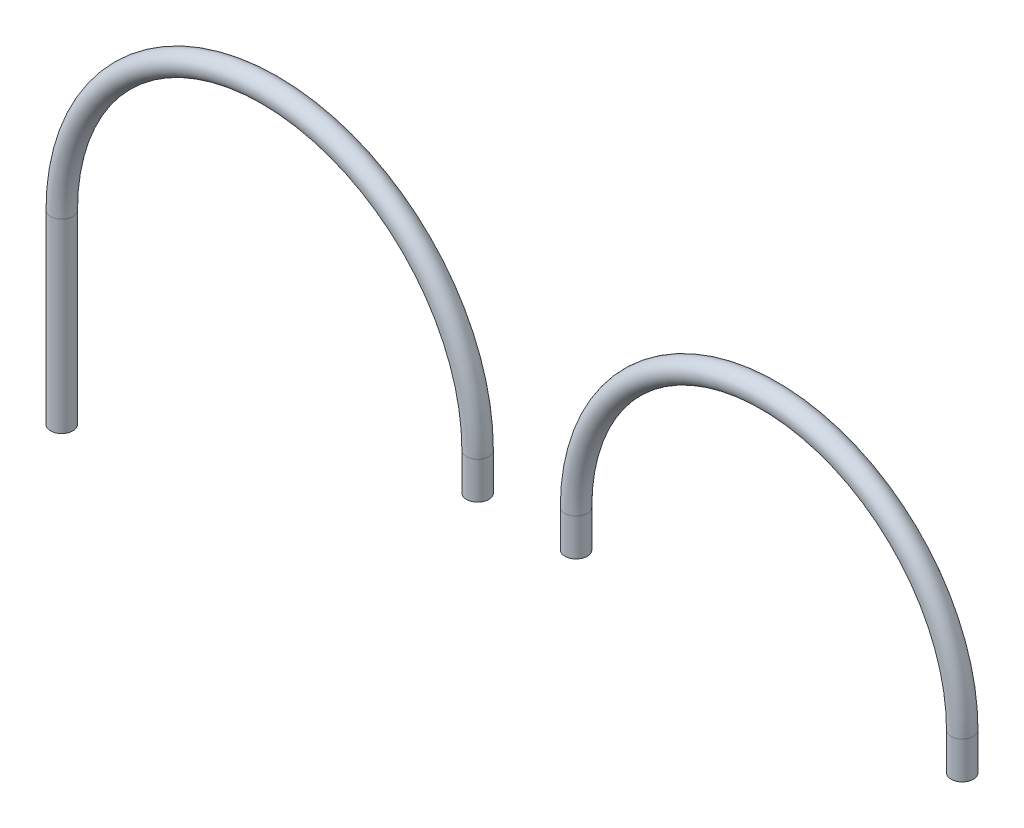
ISO-10303-21;
HEADER;
FILE_DESCRIPTION(('STEP AP214'),'2;1');
FILE_NAME('part.step','',(''),(''),'','','');
FILE_SCHEMA(('AUTOMOTIVE_DESIGN { 1 0 10303 214 1 1 1 1 }'));
ENDSEC;
DATA;
#1=APPLICATION_CONTEXT('core data for automotive mechanical design processes');
#2=APPLICATION_PROTOCOL_DEFINITION('international standard','automotive_design',2000,#1);
#3=PRODUCT_CONTEXT('',#1,'mechanical');
#4=PRODUCT('Part','Part','',(#3));
#5=PRODUCT_RELATED_PRODUCT_CATEGORY('part','',(#4));
#6=PRODUCT_DEFINITION_FORMATION('','',#4);
#7=PRODUCT_DEFINITION_CONTEXT('part definition',#1,'design');
#8=PRODUCT_DEFINITION('design','',#6,#7);
#9=PRODUCT_DEFINITION_SHAPE('','',#8);
#10=(LENGTH_UNIT() NAMED_UNIT(*) SI_UNIT(.MILLI.,.METRE.));
#11=(NAMED_UNIT(*) PLANE_ANGLE_UNIT() SI_UNIT($,.RADIAN.));
#12=(NAMED_UNIT(*) SI_UNIT($,.STERADIAN.) SOLID_ANGLE_UNIT());
#13=UNCERTAINTY_MEASURE_WITH_UNIT(LENGTH_MEASURE(1.E-05),#10,'distance_accuracy_value','');
#14=(GEOMETRIC_REPRESENTATION_CONTEXT(3) GLOBAL_UNCERTAINTY_ASSIGNED_CONTEXT((#13)) GLOBAL_UNIT_ASSIGNED_CONTEXT((#10,
#11,#12)) REPRESENTATION_CONTEXT('',''));
#15=CARTESIAN_POINT('',(0.,0.,0.));
#16=DIRECTION('',(0.,0.,1.));
#17=DIRECTION('',(1.,0.,0.));
#18=AXIS2_PLACEMENT_3D('',#15,#16,#17);
#19=CARTESIAN_POINT('',(-655.955136572155,-50.,0.));
#20=DIRECTION('',(0.,1.,0.));
#21=DIRECTION('',(0.,0.,1.));
#22=AXIS2_PLACEMENT_3D('',#19,#20,#21);
#23=PLANE('',#22);
#24=CARTESIAN_POINT('',(-655.955136572155,-50.,0.));
#25=DIRECTION('',(0.,1.,0.));
#26=DIRECTION('',(0.,0.,1.));
#27=AXIS2_PLACEMENT_3D('',#24,#25,#26);
#28=CIRCLE('',#27,14.);
#29=CARTESIAN_POINT('',(-655.955136572155,-50.,14.));
#30=VERTEX_POINT('',#29);
#31=EDGE_CURVE('E227',#30,#30,#28,.T.);
#32=ORIENTED_EDGE('',*,*,#31,.T.);
#33=EDGE_LOOP('',(#32));
#34=FACE_BOUND('',#33,.T.);
#35=CARTESIAN_POINT('',(-655.955136572155,-50.,0.));
#36=DIRECTION('',(0.,1.,0.));
#37=DIRECTION('',(0.,0.,1.));
#38=AXIS2_PLACEMENT_3D('',#35,#36,#37);
#39=CIRCLE('',#38,15.);
#40=CARTESIAN_POINT('',(-655.955136572155,-50.,15.));
#41=VERTEX_POINT('',#40);
#42=EDGE_CURVE('E216',#41,#41,#39,.T.);
#43=ORIENTED_EDGE('',*,*,#42,.F.);
#44=EDGE_LOOP('',(#43));
#45=FACE_BOUND('',#44,.T.);
#46=ADVANCED_FACE('F197',(#34,#45),#23,.F.);
#47=CARTESIAN_POINT('',(-135.955136572155,-50.,0.));
#48=DIRECTION('',(0.,-1.,0.));
#49=DIRECTION('',(0.,0.,1.));
#50=AXIS2_PLACEMENT_3D('',#47,#48,#49);
#51=PLANE('',#50);
#52=CARTESIAN_POINT('',(-135.955136572155,-50.,0.));
#53=DIRECTION('',(0.,-1.,0.));
#54=DIRECTION('',(0.,0.,-1.));
#55=AXIS2_PLACEMENT_3D('',#52,#53,#54);
#56=CIRCLE('',#55,14.);
#57=CARTESIAN_POINT('',(-135.955136572155,-50.,-14.));
#58=VERTEX_POINT('',#57);
#59=EDGE_CURVE('E222',#58,#58,#56,.T.);
#60=ORIENTED_EDGE('',*,*,#59,.F.);
#61=EDGE_LOOP('',(#60));
#62=FACE_BOUND('',#61,.T.);
#63=CARTESIAN_POINT('',(-135.955136572155,-50.,0.));
#64=DIRECTION('',(0.,-1.,0.));
#65=DIRECTION('',(0.,0.,1.));
#66=AXIS2_PLACEMENT_3D('',#63,#64,#65);
#67=CIRCLE('',#66,15.);
#68=CARTESIAN_POINT('',(-135.955136572155,-50.,15.));
#69=VERTEX_POINT('',#68);
#70=EDGE_CURVE('E13',#69,#69,#67,.T.);
#71=ORIENTED_EDGE('',*,*,#70,.T.);
#72=EDGE_LOOP('',(#71));
#73=FACE_BOUND('',#72,.T.);
#74=ADVANCED_FACE('F267',(#62,#73),#51,.T.);
#75=CARTESIAN_POINT('',(-655.955136572155,-50.,0.));
#76=DIRECTION('',(0.,1.,0.));
#77=DIRECTION('',(0.,0.,1.));
#78=AXIS2_PLACEMENT_3D('',#75,#76,#77);
#79=CYLINDRICAL_SURFACE('',#78,15.);
#80=CARTESIAN_POINT('',(-655.955136572155,0.,0.));
#81=DIRECTION('',(0.,1.,0.));
#82=DIRECTION('',(0.,0.,1.));
#83=AXIS2_PLACEMENT_3D('',#80,#81,#82);
#84=CIRCLE('',#83,15.);
#85=CARTESIAN_POINT('',(-670.955136572155,0.,0.));
#86=VERTEX_POINT('',#85);
#87=EDGE_CURVE('E210',#86,#86,#84,.T.);
#88=ORIENTED_EDGE('',*,*,#87,.F.);
#89=EDGE_LOOP('',(#88));
#90=FACE_BOUND('',#89,.T.);
#91=ORIENTED_EDGE('',*,*,#42,.T.);
#92=EDGE_LOOP('',(#91));
#93=FACE_BOUND('',#92,.T.);
#94=ADVANCED_FACE('F263',(#90,#93),#79,.T.);
#95=CARTESIAN_POINT('',(-395.955136572155,0.,0.));
#96=DIRECTION('',(0.,0.,-1.));
#97=DIRECTION('',(-1.,0.,0.));
#98=AXIS2_PLACEMENT_3D('',#95,#96,#97);
#99=TOROIDAL_SURFACE('',#98,260.,15.);
#100=CARTESIAN_POINT('',(-135.955136572155,0.,0.));
#101=DIRECTION('',(0.,-1.,0.));
#102=DIRECTION('',(0.,0.,1.));
#103=AXIS2_PLACEMENT_3D('',#100,#101,#102);
#104=CIRCLE('',#103,15.);
#105=CARTESIAN_POINT('',(-120.955136572155,0.,0.));
#106=VERTEX_POINT('',#105);
#107=EDGE_CURVE('E204',#106,#106,#104,.T.);
#108=CARTESIAN_POINT('',(-395.955136572155,0.,0.));
#109=DIRECTION('',(0.,0.,-1.));
#110=DIRECTION('',(-1.,0.,0.));
#111=AXIS2_PLACEMENT_3D('',#108,#109,#110);
#112=CIRCLE('',#111,275.);
#113=EDGE_CURVE('',#86,#106,#112,.T.);
#114=ORIENTED_EDGE('',*,*,#87,.T.);
#115=ORIENTED_EDGE('',*,*,#107,.F.);
#116=ORIENTED_EDGE('',*,*,#113,.T.);
#117=ORIENTED_EDGE('',*,*,#113,.F.);
#118=EDGE_LOOP('',(#114,#116,#115,#117));
#119=FACE_BOUND('',#118,.T.);
#120=ADVANCED_FACE('F257',(#119),#99,.T.);
#121=CARTESIAN_POINT('',(-135.955136572155,0.,0.));
#122=DIRECTION('',(0.,-1.,0.));
#123=DIRECTION('',(0.,0.,-1.));
#124=AXIS2_PLACEMENT_3D('',#121,#122,#123);
#125=CYLINDRICAL_SURFACE('',#124,15.);
#126=ORIENTED_EDGE('',*,*,#70,.F.);
#127=EDGE_LOOP('',(#126));
#128=FACE_BOUND('',#127,.T.);
#129=ORIENTED_EDGE('',*,*,#107,.T.);
#130=EDGE_LOOP('',(#129));
#131=FACE_BOUND('',#130,.T.);
#132=ADVANCED_FACE('F254',(#128,#131),#125,.T.);
#133=CARTESIAN_POINT('',(-655.955136572155,-50.,0.));
#134=DIRECTION('',(0.,1.,0.));
#135=DIRECTION('',(0.,0.,1.));
#136=AXIS2_PLACEMENT_3D('',#133,#134,#135);
#137=CYLINDRICAL_SURFACE('',#136,14.);
#138=CARTESIAN_POINT('',(-655.955136572155,0.,0.));
#139=DIRECTION('',(0.,-1.,0.));
#140=DIRECTION('',(0.,0.,-1.));
#141=AXIS2_PLACEMENT_3D('',#138,#139,#140);
#142=CIRCLE('',#141,14.);
#143=CARTESIAN_POINT('',(-669.955136572155,0.,0.));
#144=VERTEX_POINT('',#143);
#145=EDGE_CURVE('E231',#144,#144,#142,.F.);
#146=ORIENTED_EDGE('',*,*,#145,.T.);
#147=EDGE_LOOP('',(#146));
#148=FACE_BOUND('',#147,.T.);
#149=ORIENTED_EDGE('',*,*,#31,.F.);
#150=EDGE_LOOP('',(#149));
#151=FACE_BOUND('',#150,.T.);
#152=ADVANCED_FACE('F240',(#148,#151),#137,.F.);
#153=CARTESIAN_POINT('',(-395.955136572155,0.,0.));
#154=DIRECTION('',(0.,0.,-1.));
#155=DIRECTION('',(-1.,0.,0.));
#156=AXIS2_PLACEMENT_3D('',#153,#154,#155);
#157=TOROIDAL_SURFACE('',#156,260.,14.);
#158=CARTESIAN_POINT('',(-135.955136572155,0.,0.));
#159=DIRECTION('',(0.,-1.,0.));
#160=DIRECTION('',(0.,0.,-1.));
#161=AXIS2_PLACEMENT_3D('',#158,#159,#160);
#162=CIRCLE('',#161,14.);
#163=CARTESIAN_POINT('',(-121.955136572155,0.,0.));
#164=VERTEX_POINT('',#163);
#165=EDGE_CURVE('E226',#164,#164,#162,.T.);
#166=CARTESIAN_POINT('',(-395.955136572155,0.,0.));
#167=DIRECTION('',(0.,0.,-1.));
#168=DIRECTION('',(-1.,0.,0.));
#169=AXIS2_PLACEMENT_3D('',#166,#167,#168);
#170=CIRCLE('',#169,274.);
#171=EDGE_CURVE('',#144,#164,#170,.T.);
#172=ORIENTED_EDGE('',*,*,#145,.F.);
#173=ORIENTED_EDGE('',*,*,#165,.T.);
#174=ORIENTED_EDGE('',*,*,#171,.T.);
#175=ORIENTED_EDGE('',*,*,#171,.F.);
#176=EDGE_LOOP('',(#172,#174,#173,#175));
#177=FACE_BOUND('',#176,.T.);
#178=ADVANCED_FACE('F243',(#177),#157,.F.);
#179=CARTESIAN_POINT('',(-135.955136572155,0.,0.));
#180=DIRECTION('',(0.,-1.,0.));
#181=DIRECTION('',(0.,0.,-1.));
#182=AXIS2_PLACEMENT_3D('',#179,#180,#181);
#183=CYLINDRICAL_SURFACE('',#182,14.);
#184=ORIENTED_EDGE('',*,*,#59,.T.);
#185=EDGE_LOOP('',(#184));
#186=FACE_BOUND('',#185,.T.);
#187=ORIENTED_EDGE('',*,*,#165,.F.);
#188=EDGE_LOOP('',(#187));
#189=FACE_BOUND('',#188,.T.);
#190=ADVANCED_FACE('F245',(#186,#189),#183,.F.);
#191=CLOSED_SHELL('',(#46,#74,#94,#120,#132,#152,#178,#190));
#192=MANIFOLD_SOLID_BREP('B2',#191);
#193=CARTESIAN_POINT('',(-788.459533346049,-50.,0.));
#194=DIRECTION('',(0.,-1.,0.));
#195=DIRECTION('',(0.,0.,1.));
#196=AXIS2_PLACEMENT_3D('',#193,#194,#195);
#197=PLANE('',#196);
#198=CARTESIAN_POINT('',(-788.459533346049,-50.,0.));
#199=DIRECTION('',(0.,-1.,0.));
#200=DIRECTION('',(1.,0.,0.));
#201=AXIS2_PLACEMENT_3D('',#198,#199,#200);
#202=CIRCLE('',#201,13.9999999999999);
#203=CARTESIAN_POINT('',(-774.459533346049,-50.,0.));
#204=VERTEX_POINT('',#203);
#205=EDGE_CURVE('E381',#204,#204,#202,.T.);
#206=ORIENTED_EDGE('',*,*,#205,.F.);
#207=EDGE_LOOP('',(#206));
#208=FACE_BOUND('',#207,.T.);
#209=CARTESIAN_POINT('',(-788.459533346049,-50.,0.));
#210=DIRECTION('',(0.,-1.,0.));
#211=DIRECTION('',(0.,0.,1.));
#212=AXIS2_PLACEMENT_3D('',#209,#210,#211);
#213=CIRCLE('',#212,14.9999999999999);
#214=CARTESIAN_POINT('',(-788.459533346049,-50.,14.9999999999999));
#215=VERTEX_POINT('',#214);
#216=EDGE_CURVE('E370',#215,#215,#213,.T.);
#217=ORIENTED_EDGE('',*,*,#216,.T.);
#218=EDGE_LOOP('',(#217));
#219=FACE_BOUND('',#218,.T.);
#220=ADVANCED_FACE('F351',(#208,#219),#197,.T.);
#221=CARTESIAN_POINT('',(-1348.45953334605,-250.,0.));
#222=DIRECTION('',(0.,1.,0.));
#223=DIRECTION('',(0.,0.,1.));
#224=AXIS2_PLACEMENT_3D('',#221,#222,#223);
#225=PLANE('',#224);
#226=CARTESIAN_POINT('',(-1348.45953334605,-250.,0.));
#227=DIRECTION('',(0.,1.,0.));
#228=DIRECTION('',(0.,0.,1.));
#229=AXIS2_PLACEMENT_3D('',#226,#227,#228);
#230=CIRCLE('',#229,13.9999999999999);
#231=CARTESIAN_POINT('',(-1348.45953334605,-250.,13.9999999999999));
#232=VERTEX_POINT('',#231);
#233=EDGE_CURVE('E376',#232,#232,#230,.T.);
#234=ORIENTED_EDGE('',*,*,#233,.T.);
#235=EDGE_LOOP('',(#234));
#236=FACE_BOUND('',#235,.T.);
#237=CARTESIAN_POINT('',(-1348.45953334605,-250.,0.));
#238=DIRECTION('',(0.,1.,0.));
#239=DIRECTION('',(0.,0.,1.));
#240=AXIS2_PLACEMENT_3D('',#237,#238,#239);
#241=CIRCLE('',#240,14.9999999999999);
#242=CARTESIAN_POINT('',(-1348.45953334605,-250.,14.9999999999999));
#243=VERTEX_POINT('',#242);
#244=EDGE_CURVE('E196',#243,#243,#241,.T.);
#245=ORIENTED_EDGE('',*,*,#244,.F.);
#246=EDGE_LOOP('',(#245));
#247=FACE_BOUND('',#246,.T.);
#248=ADVANCED_FACE('F405',(#236,#247),#225,.F.);
#249=CARTESIAN_POINT('',(-788.459533346049,-50.,0.));
#250=DIRECTION('',(0.,1.,0.));
#251=DIRECTION('',(0.,0.,1.));
#252=AXIS2_PLACEMENT_3D('',#249,#250,#251);
#253=CYLINDRICAL_SURFACE('',#252,14.9999999999999);
#254=CARTESIAN_POINT('',(-788.459533346049,0.,0.));
#255=DIRECTION('',(0.,-1.,0.));
#256=DIRECTION('',(0.,0.,1.));
#257=AXIS2_PLACEMENT_3D('',#254,#255,#256);
#258=CIRCLE('',#257,14.9999999999999);
#259=CARTESIAN_POINT('',(-773.459533346049,0.,0.));
#260=VERTEX_POINT('',#259);
#261=EDGE_CURVE('E364',#260,#260,#258,.T.);
#262=ORIENTED_EDGE('',*,*,#261,.T.);
#263=EDGE_LOOP('',(#262));
#264=FACE_BOUND('',#263,.T.);
#265=ORIENTED_EDGE('',*,*,#216,.F.);
#266=EDGE_LOOP('',(#265));
#267=FACE_BOUND('',#266,.T.);
#268=ADVANCED_FACE('F409',(#264,#267),#253,.T.);
#269=CARTESIAN_POINT('',(-1068.45953334605,0.,0.));
#270=DIRECTION('',(0.,0.,1.));
#271=DIRECTION('',(1.,0.,0.));
#272=AXIS2_PLACEMENT_3D('',#269,#270,#271);
#273=TOROIDAL_SURFACE('',#272,280.,14.9999999999999);
#274=CARTESIAN_POINT('',(-1348.45953334605,1.22124532708767E-12,0.));
#275=DIRECTION('',(0.,1.,0.));
#276=DIRECTION('',(0.,0.,1.));
#277=AXIS2_PLACEMENT_3D('',#274,#275,#276);
#278=CIRCLE('',#277,14.9999999999999);
#279=CARTESIAN_POINT('',(-1363.45953334605,1.28666918389594E-12,0.));
#280=VERTEX_POINT('',#279);
#281=EDGE_CURVE('E358',#280,#280,#278,.T.);
#282=CARTESIAN_POINT('',(-1068.45953334605,0.,0.));
#283=DIRECTION('',(0.,0.,1.));
#284=DIRECTION('',(1.,0.,0.));
#285=AXIS2_PLACEMENT_3D('',#282,#283,#284);
#286=CIRCLE('',#285,295.);
#287=EDGE_CURVE('',#260,#280,#286,.T.);
#288=ORIENTED_EDGE('',*,*,#261,.F.);
#289=ORIENTED_EDGE('',*,*,#281,.T.);
#290=ORIENTED_EDGE('',*,*,#287,.T.);
#291=ORIENTED_EDGE('',*,*,#287,.F.);
#292=EDGE_LOOP('',(#288,#290,#289,#291));
#293=FACE_BOUND('',#292,.T.);
#294=ADVANCED_FACE('F411',(#293),#273,.T.);
#295=CARTESIAN_POINT('',(-1348.45953334605,0.,0.));
#296=DIRECTION('',(0.,-1.,0.));
#297=DIRECTION('',(1.,0.,0.));
#298=AXIS2_PLACEMENT_3D('',#295,#296,#297);
#299=CYLINDRICAL_SURFACE('',#298,14.9999999999999);
#300=ORIENTED_EDGE('',*,*,#244,.T.);
#301=EDGE_LOOP('',(#300));
#302=FACE_BOUND('',#301,.T.);
#303=ORIENTED_EDGE('',*,*,#281,.F.);
#304=EDGE_LOOP('',(#303));
#305=FACE_BOUND('',#304,.T.);
#306=ADVANCED_FACE('F399',(#302,#305),#299,.T.);
#307=CARTESIAN_POINT('',(-788.459533346049,-50.,0.));
#308=DIRECTION('',(0.,1.,0.));
#309=DIRECTION('',(0.,0.,1.));
#310=AXIS2_PLACEMENT_3D('',#307,#308,#309);
#311=CYLINDRICAL_SURFACE('',#310,13.9999999999999);
#312=CARTESIAN_POINT('',(-788.459533346049,0.,0.));
#313=DIRECTION('',(0.,1.,0.));
#314=DIRECTION('',(0.,0.,1.));
#315=AXIS2_PLACEMENT_3D('',#312,#313,#314);
#316=CIRCLE('',#315,13.9999999999999);
#317=CARTESIAN_POINT('',(-774.459533346049,0.,0.));
#318=VERTEX_POINT('',#317);
#319=EDGE_CURVE('E385',#318,#318,#316,.F.);
#320=ORIENTED_EDGE('',*,*,#319,.F.);
#321=EDGE_LOOP('',(#320));
#322=FACE_BOUND('',#321,.T.);
#323=ORIENTED_EDGE('',*,*,#205,.T.);
#324=EDGE_LOOP('',(#323));
#325=FACE_BOUND('',#324,.T.);
#326=ADVANCED_FACE('F396',(#322,#325),#311,.F.);
#327=CARTESIAN_POINT('',(-1068.45953334605,0.,0.));
#328=DIRECTION('',(0.,0.,1.));
#329=DIRECTION('',(1.,0.,0.));
#330=AXIS2_PLACEMENT_3D('',#327,#328,#329);
#331=TOROIDAL_SURFACE('',#330,280.,13.9999999999999);
#332=CARTESIAN_POINT('',(-1348.45953334605,1.2777398979563E-12,0.));
#333=DIRECTION('',(0.,1.,0.));
#334=DIRECTION('',(-1.,0.,0.));
#335=AXIS2_PLACEMENT_3D('',#332,#333,#334);
#336=CIRCLE('',#335,13.9999999999999);
#337=CARTESIAN_POINT('',(-1362.45953334605,1.34162689285412E-12,0.));
#338=VERTEX_POINT('',#337);
#339=EDGE_CURVE('E380',#338,#338,#336,.T.);
#340=CARTESIAN_POINT('',(-1068.45953334605,0.,0.));
#341=DIRECTION('',(0.,0.,1.));
#342=DIRECTION('',(1.,0.,0.));
#343=AXIS2_PLACEMENT_3D('',#340,#341,#342);
#344=CIRCLE('',#343,294.);
#345=EDGE_CURVE('',#318,#338,#344,.T.);
#346=ORIENTED_EDGE('',*,*,#319,.T.);
#347=ORIENTED_EDGE('',*,*,#339,.F.);
#348=ORIENTED_EDGE('',*,*,#345,.T.);
#349=ORIENTED_EDGE('',*,*,#345,.F.);
#350=EDGE_LOOP('',(#346,#348,#347,#349));
#351=FACE_BOUND('',#350,.T.);
#352=ADVANCED_FACE('F394',(#351),#331,.F.);
#353=CARTESIAN_POINT('',(-1348.45953334605,0.,0.));
#354=DIRECTION('',(0.,-1.,0.));
#355=DIRECTION('',(1.,0.,0.));
#356=AXIS2_PLACEMENT_3D('',#353,#354,#355);
#357=CYLINDRICAL_SURFACE('',#356,13.9999999999999);
#358=ORIENTED_EDGE('',*,*,#233,.F.);
#359=EDGE_LOOP('',(#358));
#360=FACE_BOUND('',#359,.T.);
#361=ORIENTED_EDGE('',*,*,#339,.T.);
#362=EDGE_LOOP('',(#361));
#363=FACE_BOUND('',#362,.T.);
#364=ADVANCED_FACE('F406',(#360,#363),#357,.F.);
#365=CLOSED_SHELL('',(#220,#248,#268,#294,#306,#326,#352,#364));
#366=MANIFOLD_SOLID_BREP('B8',#365);
#367=ADVANCED_BREP_SHAPE_REPRESENTATION('',(#18,#192,#366),#14);
#368=SHAPE_DEFINITION_REPRESENTATION(#9,#367);
ENDSEC;
END-ISO-10303-21;
